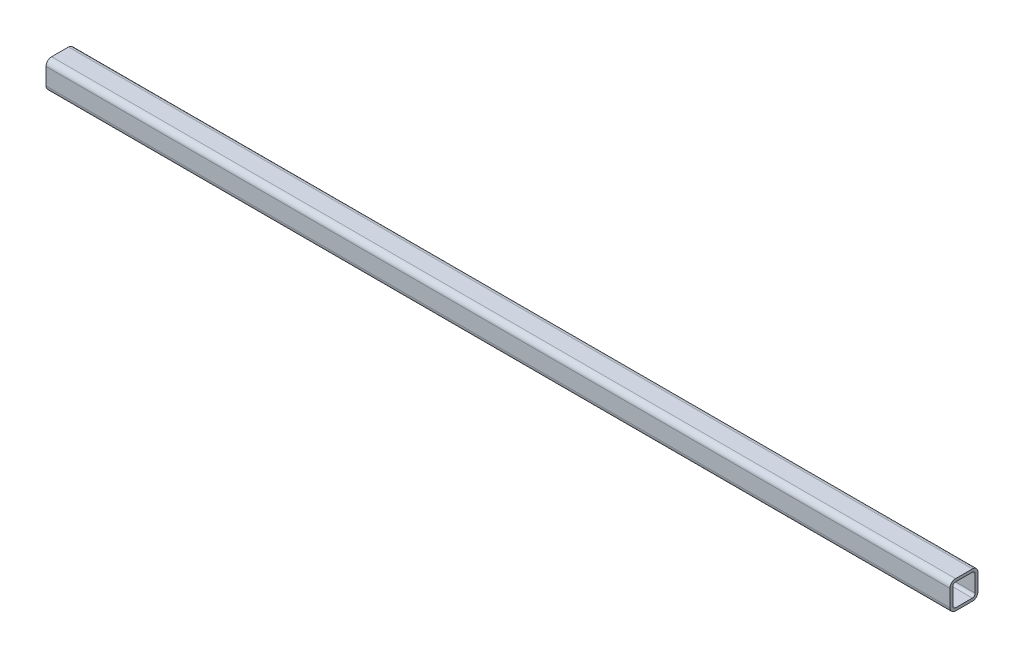
ISO-10303-21;
HEADER;
FILE_DESCRIPTION(('STEP AP214'),'2;1');
FILE_NAME('part.step','',(''),(''),'','','');
FILE_SCHEMA(('AUTOMOTIVE_DESIGN { 1 0 10303 214 1 1 1 1 }'));
ENDSEC;
DATA;
#1=APPLICATION_CONTEXT('core data for automotive mechanical design processes');
#2=APPLICATION_PROTOCOL_DEFINITION('international standard','automotive_design',2000,#1);
#3=PRODUCT_CONTEXT('',#1,'mechanical');
#4=PRODUCT('Part','Part','',(#3));
#5=PRODUCT_RELATED_PRODUCT_CATEGORY('part','',(#4));
#6=PRODUCT_DEFINITION_FORMATION('','',#4);
#7=PRODUCT_DEFINITION_CONTEXT('part definition',#1,'design');
#8=PRODUCT_DEFINITION('design','',#6,#7);
#9=PRODUCT_DEFINITION_SHAPE('','',#8);
#10=(LENGTH_UNIT() NAMED_UNIT(*) SI_UNIT(.MILLI.,.METRE.));
#11=(NAMED_UNIT(*) PLANE_ANGLE_UNIT() SI_UNIT($,.RADIAN.));
#12=(NAMED_UNIT(*) SI_UNIT($,.STERADIAN.) SOLID_ANGLE_UNIT());
#13=UNCERTAINTY_MEASURE_WITH_UNIT(LENGTH_MEASURE(1.E-05),#10,'distance_accuracy_value','');
#14=(GEOMETRIC_REPRESENTATION_CONTEXT(3) GLOBAL_UNCERTAINTY_ASSIGNED_CONTEXT((#13)) GLOBAL_UNIT_ASSIGNED_CONTEXT((#10,
#11,#12)) REPRESENTATION_CONTEXT('',''));
#15=CARTESIAN_POINT('',(0.,0.,0.));
#16=DIRECTION('',(0.,0.,1.));
#17=DIRECTION('',(1.,0.,0.));
#18=AXIS2_PLACEMENT_3D('',#15,#16,#17);
#19=CARTESIAN_POINT('',(322.5,6.,-6.00000000000012));
#20=DIRECTION('',(-1.,0.,0.));
#21=DIRECTION('',(0.,0.,1.));
#22=AXIS2_PLACEMENT_3D('',#19,#20,#21);
#23=CYLINDRICAL_SURFACE('',#22,4.);
#24=CARTESIAN_POINT('',(-322.5,6.,-6.));
#25=DIRECTION('',(1.,0.,0.));
#26=DIRECTION('',(0.,0.,-1.));
#27=AXIS2_PLACEMENT_3D('',#24,#25,#26);
#28=CIRCLE('',#27,4.);
#29=CARTESIAN_POINT('',(-322.5,6.,-10.));
#30=VERTEX_POINT('',#29);
#31=CARTESIAN_POINT('',(-322.5,10.,-6.));
#32=VERTEX_POINT('',#31);
#33=EDGE_CURVE('E235',#30,#32,#28,.T.);
#34=ORIENTED_EDGE('',*,*,#33,.T.);
#35=DIRECTION('',(-1.,0.,0.));
#36=VECTOR('',#35,1.);
#37=CARTESIAN_POINT('',(322.5,10.,-6.00000000000012));
#38=LINE('',#37,#36);
#39=CARTESIAN_POINT('',(322.5,10.,-6.00000000000012));
#40=VERTEX_POINT('',#39);
#41=EDGE_CURVE('E12',#40,#32,#38,.T.);
#42=ORIENTED_EDGE('',*,*,#41,.F.);
#43=CARTESIAN_POINT('',(322.5,6.,-6.00000000000012));
#44=DIRECTION('',(1.,0.,0.));
#45=DIRECTION('',(0.,0.,-1.));
#46=AXIS2_PLACEMENT_3D('',#43,#44,#45);
#47=CIRCLE('',#46,4.);
#48=CARTESIAN_POINT('',(322.5,6.,-10.0000000000001));
#49=VERTEX_POINT('',#48);
#50=EDGE_CURVE('E313',#49,#40,#47,.T.);
#51=ORIENTED_EDGE('',*,*,#50,.F.);
#52=DIRECTION('',(-1.,0.,0.));
#53=VECTOR('',#52,1.);
#54=CARTESIAN_POINT('',(322.5,6.,-10.0000000000001));
#55=LINE('',#54,#53);
#56=EDGE_CURVE('E250',#49,#30,#55,.T.);
#57=ORIENTED_EDGE('',*,*,#56,.T.);
#58=EDGE_LOOP('',(#34,#42,#51,#57));
#59=FACE_BOUND('',#58,.T.);
#60=ADVANCED_FACE('F63',(#59),#23,.T.);
#61=CARTESIAN_POINT('',(322.5,10.,-6.00000000000012));
#62=DIRECTION('',(0.,-1.,0.));
#63=DIRECTION('',(0.,0.,-1.));
#64=AXIS2_PLACEMENT_3D('',#61,#62,#63);
#65=PLANE('',#64);
#66=DIRECTION('',(0.,0.,1.));
#67=VECTOR('',#66,1.);
#68=CARTESIAN_POINT('',(-322.5,10.,-6.));
#69=LINE('',#68,#67);
#70=CARTESIAN_POINT('',(-322.5,10.,6.));
#71=VERTEX_POINT('',#70);
#72=EDGE_CURVE('E238',#32,#71,#69,.T.);
#73=ORIENTED_EDGE('',*,*,#72,.T.);
#74=DIRECTION('',(-1.,0.,0.));
#75=VECTOR('',#74,1.);
#76=CARTESIAN_POINT('',(322.5,10.,5.99999999999988));
#77=LINE('',#76,#75);
#78=CARTESIAN_POINT('',(322.5,10.,5.99999999999988));
#79=VERTEX_POINT('',#78);
#80=EDGE_CURVE('E73',#79,#71,#77,.T.);
#81=ORIENTED_EDGE('',*,*,#80,.F.);
#82=DIRECTION('',(0.,0.,1.));
#83=VECTOR('',#82,1.);
#84=CARTESIAN_POINT('',(322.5,10.,-6.00000000000012));
#85=LINE('',#84,#83);
#86=EDGE_CURVE('E315',#40,#79,#85,.T.);
#87=ORIENTED_EDGE('',*,*,#86,.F.);
#88=ORIENTED_EDGE('',*,*,#41,.T.);
#89=EDGE_LOOP('',(#73,#81,#87,#88));
#90=FACE_BOUND('',#89,.T.);
#91=ADVANCED_FACE('F350',(#90),#65,.F.);
#92=CARTESIAN_POINT('',(322.5,6.,5.99999999999988));
#93=DIRECTION('',(-1.,0.,0.));
#94=DIRECTION('',(0.,0.,1.));
#95=AXIS2_PLACEMENT_3D('',#92,#93,#94);
#96=CYLINDRICAL_SURFACE('',#95,4.);
#97=CARTESIAN_POINT('',(-322.5,6.,6.));
#98=DIRECTION('',(1.,0.,0.));
#99=DIRECTION('',(0.,0.,-1.));
#100=AXIS2_PLACEMENT_3D('',#97,#98,#99);
#101=CIRCLE('',#100,4.);
#102=CARTESIAN_POINT('',(-322.5,6.,10.));
#103=VERTEX_POINT('',#102);
#104=EDGE_CURVE('E240',#71,#103,#101,.T.);
#105=ORIENTED_EDGE('',*,*,#104,.T.);
#106=DIRECTION('',(-1.,0.,0.));
#107=VECTOR('',#106,1.);
#108=CARTESIAN_POINT('',(322.5,6.,9.99999999999988));
#109=LINE('',#108,#107);
#110=CARTESIAN_POINT('',(322.5,6.,9.99999999999988));
#111=VERTEX_POINT('',#110);
#112=EDGE_CURVE('E257',#111,#103,#109,.T.);
#113=ORIENTED_EDGE('',*,*,#112,.F.);
#114=CARTESIAN_POINT('',(322.5,6.,5.99999999999988));
#115=DIRECTION('',(1.,0.,0.));
#116=DIRECTION('',(0.,0.,-1.));
#117=AXIS2_PLACEMENT_3D('',#114,#115,#116);
#118=CIRCLE('',#117,4.);
#119=EDGE_CURVE('E317',#79,#111,#118,.T.);
#120=ORIENTED_EDGE('',*,*,#119,.F.);
#121=ORIENTED_EDGE('',*,*,#80,.T.);
#122=EDGE_LOOP('',(#105,#113,#120,#121));
#123=FACE_BOUND('',#122,.T.);
#124=ADVANCED_FACE('F355',(#123),#96,.T.);
#125=CARTESIAN_POINT('',(322.5,-6.,9.99999999999988));
#126=DIRECTION('',(0.,0.,-1.));
#127=DIRECTION('',(-1.,0.,0.));
#128=AXIS2_PLACEMENT_3D('',#125,#126,#127);
#129=PLANE('',#128);
#130=DIRECTION('',(0.,-1.,0.));
#131=VECTOR('',#130,1.);
#132=CARTESIAN_POINT('',(-322.5,-6.,10.));
#133=LINE('',#132,#131);
#134=CARTESIAN_POINT('',(-322.5,-6.,10.));
#135=VERTEX_POINT('',#134);
#136=EDGE_CURVE('E242',#103,#135,#133,.T.);
#137=ORIENTED_EDGE('',*,*,#136,.T.);
#138=DIRECTION('',(-1.,0.,0.));
#139=VECTOR('',#138,1.);
#140=CARTESIAN_POINT('',(322.5,-6.,9.99999999999988));
#141=LINE('',#140,#139);
#142=CARTESIAN_POINT('',(322.5,-6.,9.99999999999988));
#143=VERTEX_POINT('',#142);
#144=EDGE_CURVE('E254',#143,#135,#141,.T.);
#145=ORIENTED_EDGE('',*,*,#144,.F.);
#146=DIRECTION('',(0.,-1.,0.));
#147=VECTOR('',#146,1.);
#148=CARTESIAN_POINT('',(322.5,-6.,9.99999999999988));
#149=LINE('',#148,#147);
#150=EDGE_CURVE('E319',#111,#143,#149,.T.);
#151=ORIENTED_EDGE('',*,*,#150,.F.);
#152=ORIENTED_EDGE('',*,*,#112,.T.);
#153=EDGE_LOOP('',(#137,#145,#151,#152));
#154=FACE_BOUND('',#153,.T.);
#155=ADVANCED_FACE('F325',(#154),#129,.F.);
#156=CARTESIAN_POINT('',(322.5,-6.,5.99999999999988));
#157=DIRECTION('',(-1.,0.,0.));
#158=DIRECTION('',(0.,0.,1.));
#159=AXIS2_PLACEMENT_3D('',#156,#157,#158);
#160=CYLINDRICAL_SURFACE('',#159,4.);
#161=CARTESIAN_POINT('',(-322.5,-6.,6.));
#162=DIRECTION('',(1.,0.,0.));
#163=DIRECTION('',(0.,0.,-1.));
#164=AXIS2_PLACEMENT_3D('',#161,#162,#163);
#165=CIRCLE('',#164,4.);
#166=CARTESIAN_POINT('',(-322.5,-10.,6.));
#167=VERTEX_POINT('',#166);
#168=EDGE_CURVE('E244',#135,#167,#165,.T.);
#169=ORIENTED_EDGE('',*,*,#168,.T.);
#170=DIRECTION('',(-1.,0.,0.));
#171=VECTOR('',#170,1.);
#172=CARTESIAN_POINT('',(322.5,-10.,5.99999999999988));
#173=LINE('',#172,#171);
#174=CARTESIAN_POINT('',(322.5,-10.,5.99999999999988));
#175=VERTEX_POINT('',#174);
#176=EDGE_CURVE('E202',#175,#167,#173,.T.);
#177=ORIENTED_EDGE('',*,*,#176,.F.);
#178=CARTESIAN_POINT('',(322.5,-6.,5.99999999999988));
#179=DIRECTION('',(1.,0.,0.));
#180=DIRECTION('',(0.,0.,-1.));
#181=AXIS2_PLACEMENT_3D('',#178,#179,#180);
#182=CIRCLE('',#181,4.);
#183=EDGE_CURVE('E193',#143,#175,#182,.T.);
#184=ORIENTED_EDGE('',*,*,#183,.F.);
#185=ORIENTED_EDGE('',*,*,#144,.T.);
#186=EDGE_LOOP('',(#169,#177,#184,#185));
#187=FACE_BOUND('',#186,.T.);
#188=ADVANCED_FACE('F329',(#187),#160,.T.);
#189=CARTESIAN_POINT('',(322.5,-10.,5.99999999999988));
#190=DIRECTION('',(0.,1.,0.));
#191=DIRECTION('',(0.,0.,1.));
#192=AXIS2_PLACEMENT_3D('',#189,#190,#191);
#193=PLANE('',#192);
#194=DIRECTION('',(0.,0.,-1.));
#195=VECTOR('',#194,1.);
#196=CARTESIAN_POINT('',(-322.5,-10.,6.));
#197=LINE('',#196,#195);
#198=CARTESIAN_POINT('',(-322.5,-10.,-6.));
#199=VERTEX_POINT('',#198);
#200=EDGE_CURVE('E201',#167,#199,#197,.T.);
#201=ORIENTED_EDGE('',*,*,#200,.T.);
#202=DIRECTION('',(-1.,0.,0.));
#203=VECTOR('',#202,1.);
#204=CARTESIAN_POINT('',(322.5,-10.,-6.00000000000012));
#205=LINE('',#204,#203);
#206=CARTESIAN_POINT('',(322.5,-10.,-6.00000000000012));
#207=VERTEX_POINT('',#206);
#208=EDGE_CURVE('E198',#207,#199,#205,.T.);
#209=ORIENTED_EDGE('',*,*,#208,.F.);
#210=DIRECTION('',(0.,0.,-1.));
#211=VECTOR('',#210,1.);
#212=CARTESIAN_POINT('',(322.5,-10.,5.99999999999988));
#213=LINE('',#212,#211);
#214=EDGE_CURVE('E187',#175,#207,#213,.T.);
#215=ORIENTED_EDGE('',*,*,#214,.F.);
#216=ORIENTED_EDGE('',*,*,#176,.T.);
#217=EDGE_LOOP('',(#201,#209,#215,#216));
#218=FACE_BOUND('',#217,.T.);
#219=ADVANCED_FACE('F199',(#218),#193,.F.);
#220=CARTESIAN_POINT('',(322.5,-6.,-6.00000000000012));
#221=DIRECTION('',(-1.,0.,0.));
#222=DIRECTION('',(0.,0.,1.));
#223=AXIS2_PLACEMENT_3D('',#220,#221,#222);
#224=CYLINDRICAL_SURFACE('',#223,4.);
#225=CARTESIAN_POINT('',(-322.5,-6.,-6.));
#226=DIRECTION('',(1.,0.,0.));
#227=DIRECTION('',(0.,0.,-1.));
#228=AXIS2_PLACEMENT_3D('',#225,#226,#227);
#229=CIRCLE('',#228,4.);
#230=CARTESIAN_POINT('',(-322.5,-6.,-10.));
#231=VERTEX_POINT('',#230);
#232=EDGE_CURVE('E135',#199,#231,#229,.T.);
#233=ORIENTED_EDGE('',*,*,#232,.T.);
#234=DIRECTION('',(-1.,0.,0.));
#235=VECTOR('',#234,1.);
#236=CARTESIAN_POINT('',(322.5,-6.,-10.0000000000001));
#237=LINE('',#236,#235);
#238=CARTESIAN_POINT('',(322.5,-6.,-10.0000000000001));
#239=VERTEX_POINT('',#238);
#240=EDGE_CURVE('E203',#239,#231,#237,.T.);
#241=ORIENTED_EDGE('',*,*,#240,.F.);
#242=CARTESIAN_POINT('',(322.5,-6.,-6.00000000000012));
#243=DIRECTION('',(1.,0.,0.));
#244=DIRECTION('',(0.,0.,-1.));
#245=AXIS2_PLACEMENT_3D('',#242,#243,#244);
#246=CIRCLE('',#245,4.);
#247=EDGE_CURVE('E191',#207,#239,#246,.T.);
#248=ORIENTED_EDGE('',*,*,#247,.F.);
#249=ORIENTED_EDGE('',*,*,#208,.T.);
#250=EDGE_LOOP('',(#233,#241,#248,#249));
#251=FACE_BOUND('',#250,.T.);
#252=ADVANCED_FACE('F205',(#251),#224,.T.);
#253=CARTESIAN_POINT('',(322.5,6.,5.99999999999988));
#254=DIRECTION('',(-1.,0.,0.));
#255=DIRECTION('',(0.,0.,1.));
#256=AXIS2_PLACEMENT_3D('',#253,#254,#255);
#257=CYLINDRICAL_SURFACE('',#256,2.);
#258=CARTESIAN_POINT('',(-322.5,6.,6.));
#259=DIRECTION('',(1.,0.,0.));
#260=DIRECTION('',(0.,0.,-1.));
#261=AXIS2_PLACEMENT_3D('',#258,#259,#260);
#262=CIRCLE('',#261,2.);
#263=CARTESIAN_POINT('',(-322.5,8.,6.));
#264=VERTEX_POINT('',#263);
#265=CARTESIAN_POINT('',(-322.5,6.,8.));
#266=VERTEX_POINT('',#265);
#267=EDGE_CURVE('E211',#264,#266,#262,.T.);
#268=ORIENTED_EDGE('',*,*,#267,.F.);
#269=DIRECTION('',(-1.,0.,0.));
#270=VECTOR('',#269,1.);
#271=CARTESIAN_POINT('',(322.5,8.,5.99999999999988));
#272=LINE('',#271,#270);
#273=CARTESIAN_POINT('',(322.5,8.,5.99999999999988));
#274=VERTEX_POINT('',#273);
#275=EDGE_CURVE('E67',#274,#264,#272,.T.);
#276=ORIENTED_EDGE('',*,*,#275,.F.);
#277=CARTESIAN_POINT('',(322.5,6.,5.99999999999988));
#278=DIRECTION('',(1.,0.,0.));
#279=DIRECTION('',(0.,0.,-1.));
#280=AXIS2_PLACEMENT_3D('',#277,#278,#279);
#281=CIRCLE('',#280,2.);
#282=CARTESIAN_POINT('',(322.5,6.,7.99999999999988));
#283=VERTEX_POINT('',#282);
#284=EDGE_CURVE('E249',#274,#283,#281,.T.);
#285=ORIENTED_EDGE('',*,*,#284,.T.);
#286=DIRECTION('',(-1.,0.,0.));
#287=VECTOR('',#286,1.);
#288=CARTESIAN_POINT('',(322.5,6.,7.99999999999988));
#289=LINE('',#288,#287);
#290=EDGE_CURVE('E207',#283,#266,#289,.T.);
#291=ORIENTED_EDGE('',*,*,#290,.T.);
#292=EDGE_LOOP('',(#268,#276,#285,#291));
#293=FACE_BOUND('',#292,.T.);
#294=ADVANCED_FACE('F65',(#293),#257,.F.);
#295=CARTESIAN_POINT('',(322.5,8.,-6.00000000000012));
#296=DIRECTION('',(0.,-1.,0.));
#297=DIRECTION('',(0.,0.,-1.));
#298=AXIS2_PLACEMENT_3D('',#295,#296,#297);
#299=PLANE('',#298);
#300=DIRECTION('',(0.,0.,1.));
#301=VECTOR('',#300,1.);
#302=CARTESIAN_POINT('',(-322.5,8.,-6.));
#303=LINE('',#302,#301);
#304=CARTESIAN_POINT('',(-322.5,8.,-6.));
#305=VERTEX_POINT('',#304);
#306=EDGE_CURVE('E214',#305,#264,#303,.T.);
#307=ORIENTED_EDGE('',*,*,#306,.F.);
#308=DIRECTION('',(-1.,0.,0.));
#309=VECTOR('',#308,1.);
#310=CARTESIAN_POINT('',(322.5,8.,-6.00000000000012));
#311=LINE('',#310,#309);
#312=CARTESIAN_POINT('',(322.5,8.,-6.00000000000012));
#313=VERTEX_POINT('',#312);
#314=EDGE_CURVE('E272',#313,#305,#311,.T.);
#315=ORIENTED_EDGE('',*,*,#314,.F.);
#316=DIRECTION('',(0.,0.,1.));
#317=VECTOR('',#316,1.);
#318=CARTESIAN_POINT('',(322.5,8.,-6.00000000000012));
#319=LINE('',#318,#317);
#320=EDGE_CURVE('E281',#313,#274,#319,.T.);
#321=ORIENTED_EDGE('',*,*,#320,.T.);
#322=ORIENTED_EDGE('',*,*,#275,.T.);
#323=EDGE_LOOP('',(#307,#315,#321,#322));
#324=FACE_BOUND('',#323,.T.);
#325=ADVANCED_FACE('F279',(#324),#299,.T.);
#326=CARTESIAN_POINT('',(322.5,6.,-6.00000000000012));
#327=DIRECTION('',(-1.,0.,0.));
#328=DIRECTION('',(0.,0.,1.));
#329=AXIS2_PLACEMENT_3D('',#326,#327,#328);
#330=CYLINDRICAL_SURFACE('',#329,2.);
#331=CARTESIAN_POINT('',(-322.5,6.,-6.));
#332=DIRECTION('',(1.,0.,0.));
#333=DIRECTION('',(0.,0.,-1.));
#334=AXIS2_PLACEMENT_3D('',#331,#332,#333);
#335=CIRCLE('',#334,2.);
#336=CARTESIAN_POINT('',(-322.5,6.,-8.));
#337=VERTEX_POINT('',#336);
#338=EDGE_CURVE('E217',#337,#305,#335,.T.);
#339=ORIENTED_EDGE('',*,*,#338,.F.);
#340=DIRECTION('',(-1.,0.,0.));
#341=VECTOR('',#340,1.);
#342=CARTESIAN_POINT('',(322.5,6.,-8.00000000000012));
#343=LINE('',#342,#341);
#344=CARTESIAN_POINT('',(322.5,6.,-8.00000000000012));
#345=VERTEX_POINT('',#344);
#346=EDGE_CURVE('E271',#345,#337,#343,.T.);
#347=ORIENTED_EDGE('',*,*,#346,.F.);
#348=CARTESIAN_POINT('',(322.5,6.,-6.00000000000012));
#349=DIRECTION('',(1.,0.,0.));
#350=DIRECTION('',(0.,0.,-1.));
#351=AXIS2_PLACEMENT_3D('',#348,#349,#350);
#352=CIRCLE('',#351,2.);
#353=EDGE_CURVE('E289',#345,#313,#352,.T.);
#354=ORIENTED_EDGE('',*,*,#353,.T.);
#355=ORIENTED_EDGE('',*,*,#314,.T.);
#356=EDGE_LOOP('',(#339,#347,#354,#355));
#357=FACE_BOUND('',#356,.T.);
#358=ADVANCED_FACE('F287',(#357),#330,.F.);
#359=CARTESIAN_POINT('',(322.5,6.,-8.00000000000012));
#360=DIRECTION('',(0.,0.,1.));
#361=DIRECTION('',(1.,0.,0.));
#362=AXIS2_PLACEMENT_3D('',#359,#360,#361);
#363=PLANE('',#362);
#364=DIRECTION('',(0.,1.,0.));
#365=VECTOR('',#364,1.);
#366=CARTESIAN_POINT('',(-322.5,6.,-8.));
#367=LINE('',#366,#365);
#368=CARTESIAN_POINT('',(-322.5,-6.,-8.));
#369=VERTEX_POINT('',#368);
#370=EDGE_CURVE('E220',#369,#337,#367,.T.);
#371=ORIENTED_EDGE('',*,*,#370,.F.);
#372=DIRECTION('',(-1.,0.,0.));
#373=VECTOR('',#372,1.);
#374=CARTESIAN_POINT('',(322.5,-6.,-8.00000000000012));
#375=LINE('',#374,#373);
#376=CARTESIAN_POINT('',(322.5,-6.,-8.00000000000012));
#377=VERTEX_POINT('',#376);
#378=EDGE_CURVE('E269',#377,#369,#375,.T.);
#379=ORIENTED_EDGE('',*,*,#378,.F.);
#380=DIRECTION('',(0.,1.,0.));
#381=VECTOR('',#380,1.);
#382=CARTESIAN_POINT('',(322.5,6.,-8.00000000000012));
#383=LINE('',#382,#381);
#384=EDGE_CURVE('E295',#377,#345,#383,.T.);
#385=ORIENTED_EDGE('',*,*,#384,.T.);
#386=ORIENTED_EDGE('',*,*,#346,.T.);
#387=EDGE_LOOP('',(#371,#379,#385,#386));
#388=FACE_BOUND('',#387,.T.);
#389=ADVANCED_FACE('F298',(#388),#363,.T.);
#390=CARTESIAN_POINT('',(322.5,-6.,-6.00000000000012));
#391=DIRECTION('',(-1.,0.,0.));
#392=DIRECTION('',(0.,0.,1.));
#393=AXIS2_PLACEMENT_3D('',#390,#391,#392);
#394=CYLINDRICAL_SURFACE('',#393,2.);
#395=CARTESIAN_POINT('',(-322.5,-6.,-6.));
#396=DIRECTION('',(1.,0.,0.));
#397=DIRECTION('',(0.,0.,-1.));
#398=AXIS2_PLACEMENT_3D('',#395,#396,#397);
#399=CIRCLE('',#398,2.);
#400=CARTESIAN_POINT('',(-322.5,-8.,-6.));
#401=VERTEX_POINT('',#400);
#402=EDGE_CURVE('E223',#401,#369,#399,.T.);
#403=ORIENTED_EDGE('',*,*,#402,.F.);
#404=DIRECTION('',(-1.,0.,0.));
#405=VECTOR('',#404,1.);
#406=CARTESIAN_POINT('',(322.5,-8.,-6.00000000000012));
#407=LINE('',#406,#405);
#408=CARTESIAN_POINT('',(322.5,-8.,-6.00000000000012));
#409=VERTEX_POINT('',#408);
#410=EDGE_CURVE('E267',#409,#401,#407,.T.);
#411=ORIENTED_EDGE('',*,*,#410,.F.);
#412=CARTESIAN_POINT('',(322.5,-6.,-6.00000000000012));
#413=DIRECTION('',(1.,0.,0.));
#414=DIRECTION('',(0.,0.,-1.));
#415=AXIS2_PLACEMENT_3D('',#412,#413,#414);
#416=CIRCLE('',#415,2.);
#417=EDGE_CURVE('E299',#409,#377,#416,.T.);
#418=ORIENTED_EDGE('',*,*,#417,.T.);
#419=ORIENTED_EDGE('',*,*,#378,.T.);
#420=EDGE_LOOP('',(#403,#411,#418,#419));
#421=FACE_BOUND('',#420,.T.);
#422=ADVANCED_FACE('F366',(#421),#394,.F.);
#423=CARTESIAN_POINT('',(322.5,-8.,5.99999999999988));
#424=DIRECTION('',(0.,1.,0.));
#425=DIRECTION('',(0.,0.,1.));
#426=AXIS2_PLACEMENT_3D('',#423,#424,#425);
#427=PLANE('',#426);
#428=DIRECTION('',(0.,0.,-1.));
#429=VECTOR('',#428,1.);
#430=CARTESIAN_POINT('',(-322.5,-8.,6.));
#431=LINE('',#430,#429);
#432=CARTESIAN_POINT('',(-322.5,-8.,6.));
#433=VERTEX_POINT('',#432);
#434=EDGE_CURVE('E226',#433,#401,#431,.T.);
#435=ORIENTED_EDGE('',*,*,#434,.F.);
#436=DIRECTION('',(-1.,0.,0.));
#437=VECTOR('',#436,1.);
#438=CARTESIAN_POINT('',(322.5,-8.,5.99999999999988));
#439=LINE('',#438,#437);
#440=CARTESIAN_POINT('',(322.5,-8.,5.99999999999988));
#441=VERTEX_POINT('',#440);
#442=EDGE_CURVE('E265',#441,#433,#439,.T.);
#443=ORIENTED_EDGE('',*,*,#442,.F.);
#444=DIRECTION('',(0.,0.,-1.));
#445=VECTOR('',#444,1.);
#446=CARTESIAN_POINT('',(322.5,-8.,5.99999999999988));
#447=LINE('',#446,#445);
#448=EDGE_CURVE('E301',#441,#409,#447,.T.);
#449=ORIENTED_EDGE('',*,*,#448,.T.);
#450=ORIENTED_EDGE('',*,*,#410,.T.);
#451=EDGE_LOOP('',(#435,#443,#449,#450));
#452=FACE_BOUND('',#451,.T.);
#453=ADVANCED_FACE('F362',(#452),#427,.T.);
#454=CARTESIAN_POINT('',(322.5,-6.,5.99999999999988));
#455=DIRECTION('',(-1.,0.,0.));
#456=DIRECTION('',(0.,0.,1.));
#457=AXIS2_PLACEMENT_3D('',#454,#455,#456);
#458=CYLINDRICAL_SURFACE('',#457,2.);
#459=CARTESIAN_POINT('',(-322.5,-6.,6.));
#460=DIRECTION('',(1.,0.,0.));
#461=DIRECTION('',(0.,0.,-1.));
#462=AXIS2_PLACEMENT_3D('',#459,#460,#461);
#463=CIRCLE('',#462,2.);
#464=CARTESIAN_POINT('',(-322.5,-6.,8.));
#465=VERTEX_POINT('',#464);
#466=EDGE_CURVE('E229',#465,#433,#463,.T.);
#467=ORIENTED_EDGE('',*,*,#466,.F.);
#468=DIRECTION('',(-1.,0.,0.));
#469=VECTOR('',#468,1.);
#470=CARTESIAN_POINT('',(322.5,-6.,7.99999999999988));
#471=LINE('',#470,#469);
#472=CARTESIAN_POINT('',(322.5,-6.,7.99999999999988));
#473=VERTEX_POINT('',#472);
#474=EDGE_CURVE('E263',#473,#465,#471,.T.);
#475=ORIENTED_EDGE('',*,*,#474,.F.);
#476=CARTESIAN_POINT('',(322.5,-6.,5.99999999999988));
#477=DIRECTION('',(1.,0.,0.));
#478=DIRECTION('',(0.,0.,-1.));
#479=AXIS2_PLACEMENT_3D('',#476,#477,#478);
#480=CIRCLE('',#479,2.);
#481=EDGE_CURVE('E307',#473,#441,#480,.T.);
#482=ORIENTED_EDGE('',*,*,#481,.T.);
#483=ORIENTED_EDGE('',*,*,#442,.T.);
#484=EDGE_LOOP('',(#467,#475,#482,#483));
#485=FACE_BOUND('',#484,.T.);
#486=ADVANCED_FACE('F344',(#485),#458,.F.);
#487=CARTESIAN_POINT('',(322.5,-6.,7.99999999999988));
#488=DIRECTION('',(0.,0.,-1.));
#489=DIRECTION('',(-1.,0.,0.));
#490=AXIS2_PLACEMENT_3D('',#487,#488,#489);
#491=PLANE('',#490);
#492=DIRECTION('',(0.,-1.,0.));
#493=VECTOR('',#492,1.);
#494=CARTESIAN_POINT('',(-322.5,-6.,8.));
#495=LINE('',#494,#493);
#496=EDGE_CURVE('E232',#266,#465,#495,.T.);
#497=ORIENTED_EDGE('',*,*,#496,.F.);
#498=ORIENTED_EDGE('',*,*,#290,.F.);
#499=DIRECTION('',(0.,-1.,0.));
#500=VECTOR('',#499,1.);
#501=CARTESIAN_POINT('',(322.5,-6.,7.99999999999988));
#502=LINE('',#501,#500);
#503=EDGE_CURVE('E310',#283,#473,#502,.T.);
#504=ORIENTED_EDGE('',*,*,#503,.T.);
#505=ORIENTED_EDGE('',*,*,#474,.T.);
#506=EDGE_LOOP('',(#497,#498,#504,#505));
#507=FACE_BOUND('',#506,.T.);
#508=ADVANCED_FACE('F337',(#507),#491,.T.);
#509=CARTESIAN_POINT('',(322.5,6.,-10.0000000000001));
#510=DIRECTION('',(0.,0.,1.));
#511=DIRECTION('',(1.,0.,0.));
#512=AXIS2_PLACEMENT_3D('',#509,#510,#511);
#513=PLANE('',#512);
#514=DIRECTION('',(0.,1.,0.));
#515=VECTOR('',#514,1.);
#516=CARTESIAN_POINT('',(-322.5,6.,-10.));
#517=LINE('',#516,#515);
#518=EDGE_CURVE('E141',#231,#30,#517,.T.);
#519=ORIENTED_EDGE('',*,*,#518,.T.);
#520=ORIENTED_EDGE('',*,*,#56,.F.);
#521=DIRECTION('',(0.,1.,0.));
#522=VECTOR('',#521,1.);
#523=CARTESIAN_POINT('',(322.5,6.,-10.0000000000001));
#524=LINE('',#523,#522);
#525=EDGE_CURVE('E82',#239,#49,#524,.T.);
#526=ORIENTED_EDGE('',*,*,#525,.F.);
#527=ORIENTED_EDGE('',*,*,#240,.T.);
#528=EDGE_LOOP('',(#519,#520,#526,#527));
#529=FACE_BOUND('',#528,.T.);
#530=ADVANCED_FACE('F335',(#529),#513,.F.);
#531=CARTESIAN_POINT('',(322.5,6.,-6.00000000000012));
#532=DIRECTION('',(1.,0.,0.));
#533=DIRECTION('',(0.,0.,-1.));
#534=AXIS2_PLACEMENT_3D('',#531,#532,#533);
#535=PLANE('',#534);
#536=ORIENTED_EDGE('',*,*,#284,.F.);
#537=ORIENTED_EDGE('',*,*,#320,.F.);
#538=ORIENTED_EDGE('',*,*,#353,.F.);
#539=ORIENTED_EDGE('',*,*,#384,.F.);
#540=ORIENTED_EDGE('',*,*,#417,.F.);
#541=ORIENTED_EDGE('',*,*,#448,.F.);
#542=ORIENTED_EDGE('',*,*,#481,.F.);
#543=ORIENTED_EDGE('',*,*,#503,.F.);
#544=EDGE_LOOP('',(#536,#537,#538,#539,#540,#541,#542,#543));
#545=FACE_BOUND('',#544,.T.);
#546=ORIENTED_EDGE('',*,*,#50,.T.);
#547=ORIENTED_EDGE('',*,*,#86,.T.);
#548=ORIENTED_EDGE('',*,*,#119,.T.);
#549=ORIENTED_EDGE('',*,*,#150,.T.);
#550=ORIENTED_EDGE('',*,*,#183,.T.);
#551=ORIENTED_EDGE('',*,*,#214,.T.);
#552=ORIENTED_EDGE('',*,*,#247,.T.);
#553=ORIENTED_EDGE('',*,*,#525,.T.);
#554=EDGE_LOOP('',(#546,#547,#548,#549,#550,#551,#552,#553));
#555=FACE_BOUND('',#554,.T.);
#556=ADVANCED_FACE('F189',(#545,#555),#535,.T.);
#557=CARTESIAN_POINT('',(-322.5,6.,-6.));
#558=DIRECTION('',(1.,0.,0.));
#559=DIRECTION('',(0.,0.,-1.));
#560=AXIS2_PLACEMENT_3D('',#557,#558,#559);
#561=PLANE('',#560);
#562=ORIENTED_EDGE('',*,*,#267,.T.);
#563=ORIENTED_EDGE('',*,*,#496,.T.);
#564=ORIENTED_EDGE('',*,*,#466,.T.);
#565=ORIENTED_EDGE('',*,*,#434,.T.);
#566=ORIENTED_EDGE('',*,*,#402,.T.);
#567=ORIENTED_EDGE('',*,*,#370,.T.);
#568=ORIENTED_EDGE('',*,*,#338,.T.);
#569=ORIENTED_EDGE('',*,*,#306,.T.);
#570=EDGE_LOOP('',(#562,#563,#564,#565,#566,#567,#568,#569));
#571=FACE_BOUND('',#570,.T.);
#572=ORIENTED_EDGE('',*,*,#33,.F.);
#573=ORIENTED_EDGE('',*,*,#518,.F.);
#574=ORIENTED_EDGE('',*,*,#232,.F.);
#575=ORIENTED_EDGE('',*,*,#200,.F.);
#576=ORIENTED_EDGE('',*,*,#168,.F.);
#577=ORIENTED_EDGE('',*,*,#136,.F.);
#578=ORIENTED_EDGE('',*,*,#104,.F.);
#579=ORIENTED_EDGE('',*,*,#72,.F.);
#580=EDGE_LOOP('',(#572,#573,#574,#575,#576,#577,#578,#579));
#581=FACE_BOUND('',#580,.T.);
#582=ADVANCED_FACE('F284',(#571,#581),#561,.F.);
#583=CLOSED_SHELL('',(#60,#91,#124,#155,#188,#219,#252,#294,#325,#358,#389,#422,#453,#486,#508,
#530,#556,#582));
#584=MANIFOLD_SOLID_BREP('B2',#583);
#585=ADVANCED_BREP_SHAPE_REPRESENTATION('',(#18,#584),#14);
#586=SHAPE_DEFINITION_REPRESENTATION(#9,#585);
ENDSEC;
END-ISO-10303-21;
